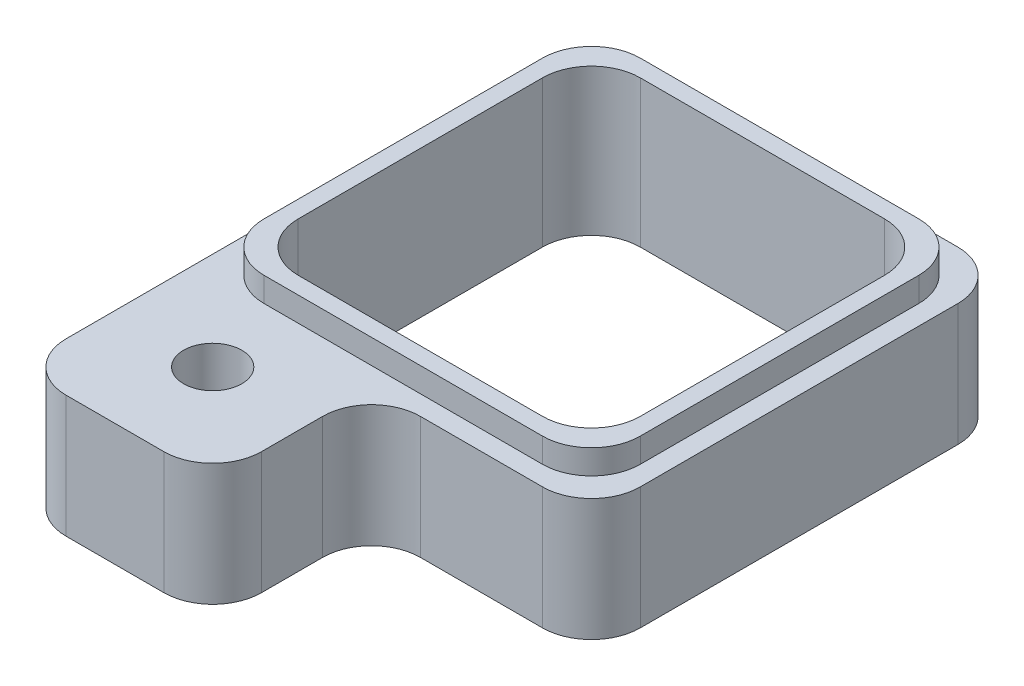
ISO-10303-21;
HEADER;
FILE_DESCRIPTION(('STEP AP214'),'2;1');
FILE_NAME('part.step','',(''),(''),'','','');
FILE_SCHEMA(('AUTOMOTIVE_DESIGN { 1 0 10303 214 1 1 1 1 }'));
ENDSEC;
DATA;
#1=APPLICATION_CONTEXT('core data for automotive mechanical design processes');
#2=APPLICATION_PROTOCOL_DEFINITION('international standard','automotive_design',2000,#1);
#3=PRODUCT_CONTEXT('',#1,'mechanical');
#4=PRODUCT('Part','Part','',(#3));
#5=PRODUCT_RELATED_PRODUCT_CATEGORY('part','',(#4));
#6=PRODUCT_DEFINITION_FORMATION('','',#4);
#7=PRODUCT_DEFINITION_CONTEXT('part definition',#1,'design');
#8=PRODUCT_DEFINITION('design','',#6,#7);
#9=PRODUCT_DEFINITION_SHAPE('','',#8);
#10=(LENGTH_UNIT() NAMED_UNIT(*) SI_UNIT(.MILLI.,.METRE.));
#11=(NAMED_UNIT(*) PLANE_ANGLE_UNIT() SI_UNIT($,.RADIAN.));
#12=(NAMED_UNIT(*) SI_UNIT($,.STERADIAN.) SOLID_ANGLE_UNIT());
#13=UNCERTAINTY_MEASURE_WITH_UNIT(LENGTH_MEASURE(1.E-05),#10,'distance_accuracy_value','');
#14=(GEOMETRIC_REPRESENTATION_CONTEXT(3) GLOBAL_UNCERTAINTY_ASSIGNED_CONTEXT((#13)) GLOBAL_UNIT_ASSIGNED_CONTEXT((#10,
#11,#12)) REPRESENTATION_CONTEXT('',''));
#15=CARTESIAN_POINT('',(0.,0.,0.));
#16=DIRECTION('',(0.,0.,1.));
#17=DIRECTION('',(1.,0.,0.));
#18=AXIS2_PLACEMENT_3D('',#15,#16,#17);
#19=CARTESIAN_POINT('',(-4.25,2.5,-4.25));
#20=DIRECTION('',(0.,0.,1.));
#21=DIRECTION('',(1.,0.,0.));
#22=AXIS2_PLACEMENT_3D('',#19,#20,#21);
#23=PLANE('',#22);
#24=DIRECTION('',(-1.,0.,0.));
#25=VECTOR('',#24,1.);
#26=CARTESIAN_POINT('',(-4.25,2.5,-4.25));
#27=LINE('',#26,#25);
#28=CARTESIAN_POINT('',(3.25,2.5,-4.25));
#29=VERTEX_POINT('',#28);
#30=CARTESIAN_POINT('',(-3.25,2.5,-4.25));
#31=VERTEX_POINT('',#30);
#32=EDGE_CURVE('E333',#29,#31,#27,.T.);
#33=ORIENTED_EDGE('',*,*,#32,.F.);
#34=DIRECTION('',(0.,-1.,0.));
#35=VECTOR('',#34,1.);
#36=CARTESIAN_POINT('',(3.25,2.5,-4.25));
#37=LINE('',#36,#35);
#38=CARTESIAN_POINT('',(3.25,0.,-4.25));
#39=VERTEX_POINT('',#38);
#40=EDGE_CURVE('E376',#29,#39,#37,.T.);
#41=ORIENTED_EDGE('',*,*,#40,.T.);
#42=DIRECTION('',(-1.,0.,0.));
#43=VECTOR('',#42,1.);
#44=CARTESIAN_POINT('',(-4.25,0.,-4.25));
#45=LINE('',#44,#43);
#46=CARTESIAN_POINT('',(1.42960296038314,0.,-4.25));
#47=VERTEX_POINT('',#46);
#48=EDGE_CURVE('E460',#39,#47,#45,.T.);
#49=ORIENTED_EDGE('',*,*,#48,.T.);
#50=DIRECTION('',(0.,-1.,0.));
#51=VECTOR('',#50,1.);
#52=CARTESIAN_POINT('',(1.42960296038314,1.,-4.25));
#53=LINE('',#52,#51);
#54=CARTESIAN_POINT('',(1.42960296038314,1.,-4.25));
#55=VERTEX_POINT('',#54);
#56=EDGE_CURVE('E260',#55,#47,#53,.T.);
#57=ORIENTED_EDGE('',*,*,#56,.F.);
#58=DIRECTION('',(1.,0.,0.));
#59=VECTOR('',#58,1.);
#60=CARTESIAN_POINT('',(1.42960296038314,1.,-4.25));
#61=LINE('',#60,#59);
#62=CARTESIAN_POINT('',(-0.570397039616865,1.,-4.25));
#63=VERTEX_POINT('',#62);
#64=EDGE_CURVE('E652',#63,#55,#61,.T.);
#65=ORIENTED_EDGE('',*,*,#64,.F.);
#66=DIRECTION('',(0.,1.,0.));
#67=VECTOR('',#66,1.);
#68=CARTESIAN_POINT('',(-0.570397039616865,1.,-4.25));
#69=LINE('',#68,#67);
#70=CARTESIAN_POINT('',(-0.570397039616865,0.,-4.25));
#71=VERTEX_POINT('',#70);
#72=EDGE_CURVE('E263',#71,#63,#69,.T.);
#73=ORIENTED_EDGE('',*,*,#72,.F.);
#74=CARTESIAN_POINT('',(-3.25,0.,-4.25));
#75=VERTEX_POINT('',#74);
#76=EDGE_CURVE('E457',#71,#75,#45,.T.);
#77=ORIENTED_EDGE('',*,*,#76,.T.);
#78=DIRECTION('',(0.,-1.,0.));
#79=VECTOR('',#78,1.);
#80=CARTESIAN_POINT('',(-3.25,2.5,-4.25));
#81=LINE('',#80,#79);
#82=EDGE_CURVE('E374',#75,#31,#81,.F.);
#83=ORIENTED_EDGE('',*,*,#82,.T.);
#84=EDGE_LOOP('',(#33,#41,#49,#57,#65,#73,#77,#83));
#85=FACE_BOUND('',#84,.T.);
#86=ADVANCED_FACE('F31',(#85),#23,.F.);
#87=CARTESIAN_POINT('',(-4.25,2.5,4.25));
#88=DIRECTION('',(0.,0.,-1.));
#89=DIRECTION('',(-1.,0.,0.));
#90=AXIS2_PLACEMENT_3D('',#87,#88,#89);
#91=PLANE('',#90);
#92=DIRECTION('',(1.,0.,0.));
#93=VECTOR('',#92,1.);
#94=CARTESIAN_POINT('',(-4.25,2.5,4.25));
#95=LINE('',#94,#93);
#96=CARTESIAN_POINT('',(0.749999999999997,2.5,4.25));
#97=VERTEX_POINT('',#96);
#98=CARTESIAN_POINT('',(3.25,2.5,4.25));
#99=VERTEX_POINT('',#98);
#100=EDGE_CURVE('E340',#97,#99,#95,.T.);
#101=ORIENTED_EDGE('',*,*,#100,.F.);
#102=DIRECTION('',(0.,1.,0.));
#103=VECTOR('',#102,1.);
#104=CARTESIAN_POINT('',(0.749999999999998,0.,4.25));
#105=LINE('',#104,#103);
#106=CARTESIAN_POINT('',(0.749999999999998,0.,4.25));
#107=VERTEX_POINT('',#106);
#108=EDGE_CURVE('E367',#97,#107,#105,.F.);
#109=ORIENTED_EDGE('',*,*,#108,.T.);
#110=DIRECTION('',(1.,0.,0.));
#111=VECTOR('',#110,1.);
#112=CARTESIAN_POINT('',(-4.25,0.,4.25));
#113=LINE('',#112,#111);
#114=CARTESIAN_POINT('',(3.25,0.,4.25));
#115=VERTEX_POINT('',#114);
#116=EDGE_CURVE('E334',#107,#115,#113,.T.);
#117=ORIENTED_EDGE('',*,*,#116,.T.);
#118=DIRECTION('',(0.,-1.,0.));
#119=VECTOR('',#118,1.);
#120=CARTESIAN_POINT('',(3.25,2.5,4.25));
#121=LINE('',#120,#119);
#122=EDGE_CURVE('E46',#115,#99,#121,.F.);
#123=ORIENTED_EDGE('',*,*,#122,.T.);
#124=EDGE_LOOP('',(#101,#109,#117,#123));
#125=FACE_BOUND('',#124,.T.);
#126=ADVANCED_FACE('F510',(#125),#91,.F.);
#127=CARTESIAN_POINT('',(4.25,2.5,-4.25));
#128=DIRECTION('',(0.,-1.,0.));
#129=DIRECTION('',(0.,0.,-1.));
#130=AXIS2_PLACEMENT_3D('',#127,#128,#129);
#131=PLANE('',#130);
#132=CARTESIAN_POINT('',(-2.25,2.5,5.5));
#133=DIRECTION('',(0.,1.,0.));
#134=DIRECTION('',(0.,0.,1.));
#135=AXIS2_PLACEMENT_3D('',#132,#133,#134);
#136=CIRCLE('',#135,0.595629999999988);
#137=CARTESIAN_POINT('',(-2.25,2.5,6.09562999999999));
#138=VERTEX_POINT('',#137);
#139=EDGE_CURVE('E264',#138,#138,#136,.T.);
#140=ORIENTED_EDGE('',*,*,#139,.F.);
#141=EDGE_LOOP('',(#140));
#142=FACE_BOUND('',#141,.T.);
#143=DIRECTION('',(0.,0.,1.));
#144=VECTOR('',#143,1.);
#145=CARTESIAN_POINT('',(-4.25,2.5,4.25));
#146=LINE('',#145,#144);
#147=CARTESIAN_POINT('',(-4.25,2.5,-3.25));
#148=VERTEX_POINT('',#147);
#149=CARTESIAN_POINT('',(-4.25,2.5,6.5));
#150=VERTEX_POINT('',#149);
#151=EDGE_CURVE('E337',#148,#150,#146,.T.);
#152=ORIENTED_EDGE('',*,*,#151,.T.);
#153=CARTESIAN_POINT('',(-3.25,2.5,6.5));
#154=DIRECTION('',(0.,-1.,0.));
#155=DIRECTION('',(0.,0.,-1.));
#156=AXIS2_PLACEMENT_3D('',#153,#154,#155);
#157=CIRCLE('',#156,1.);
#158=CARTESIAN_POINT('',(-3.25,2.5,7.5));
#159=VERTEX_POINT('',#158);
#160=EDGE_CURVE('E359',#150,#159,#157,.F.);
#161=ORIENTED_EDGE('',*,*,#160,.T.);
#162=DIRECTION('',(-1.,0.,0.));
#163=VECTOR('',#162,1.);
#164=CARTESIAN_POINT('',(-4.25,2.5,7.5));
#165=LINE('',#164,#163);
#166=CARTESIAN_POINT('',(-1.25,2.5,7.5));
#167=VERTEX_POINT('',#166);
#168=EDGE_CURVE('E300',#167,#159,#165,.T.);
#169=ORIENTED_EDGE('',*,*,#168,.F.);
#170=CARTESIAN_POINT('',(-1.25,2.5,6.5));
#171=DIRECTION('',(0.,-1.,0.));
#172=DIRECTION('',(0.,0.,-1.));
#173=AXIS2_PLACEMENT_3D('',#170,#171,#172);
#174=CIRCLE('',#173,1.);
#175=CARTESIAN_POINT('',(-0.250000000000002,2.5,6.5));
#176=VERTEX_POINT('',#175);
#177=EDGE_CURVE('E357',#167,#176,#174,.F.);
#178=ORIENTED_EDGE('',*,*,#177,.T.);
#179=DIRECTION('',(0.,0.,-1.));
#180=VECTOR('',#179,1.);
#181=CARTESIAN_POINT('',(-0.250000000000002,2.5,7.5));
#182=LINE('',#181,#180);
#183=CARTESIAN_POINT('',(-0.250000000000002,2.5,5.25));
#184=VERTEX_POINT('',#183);
#185=EDGE_CURVE('E303',#176,#184,#182,.T.);
#186=ORIENTED_EDGE('',*,*,#185,.T.);
#187=CARTESIAN_POINT('',(0.749999999999998,2.5,5.25));
#188=DIRECTION('',(0.,-1.,0.));
#189=DIRECTION('',(0.,0.,-1.));
#190=AXIS2_PLACEMENT_3D('',#187,#188,#189);
#191=CIRCLE('',#190,1.);
#192=EDGE_CURVE('E39',#184,#97,#191,.T.);
#193=ORIENTED_EDGE('',*,*,#192,.T.);
#194=ORIENTED_EDGE('',*,*,#100,.T.);
#195=CARTESIAN_POINT('',(3.25,2.5,3.25));
#196=DIRECTION('',(0.,-1.,0.));
#197=DIRECTION('',(0.,0.,-1.));
#198=AXIS2_PLACEMENT_3D('',#195,#196,#197);
#199=CIRCLE('',#198,1.);
#200=CARTESIAN_POINT('',(4.25,2.5,3.25));
#201=VERTEX_POINT('',#200);
#202=EDGE_CURVE('E355',#99,#201,#199,.F.);
#203=ORIENTED_EDGE('',*,*,#202,.T.);
#204=DIRECTION('',(0.,0.,-1.));
#205=VECTOR('',#204,1.);
#206=CARTESIAN_POINT('',(4.25,2.5,4.25));
#207=LINE('',#206,#205);
#208=CARTESIAN_POINT('',(4.25,2.5,-3.25));
#209=VERTEX_POINT('',#208);
#210=EDGE_CURVE('E330',#201,#209,#207,.T.);
#211=ORIENTED_EDGE('',*,*,#210,.T.);
#212=CARTESIAN_POINT('',(3.25,2.5,-3.25));
#213=DIRECTION('',(0.,-1.,0.));
#214=DIRECTION('',(0.,0.,-1.));
#215=AXIS2_PLACEMENT_3D('',#212,#213,#214);
#216=CIRCLE('',#215,1.);
#217=EDGE_CURVE('E352',#209,#29,#216,.F.);
#218=ORIENTED_EDGE('',*,*,#217,.T.);
#219=ORIENTED_EDGE('',*,*,#32,.T.);
#220=CARTESIAN_POINT('',(-3.25,2.5,-3.25));
#221=DIRECTION('',(0.,-1.,0.));
#222=DIRECTION('',(0.,0.,-1.));
#223=AXIS2_PLACEMENT_3D('',#220,#221,#222);
#224=CIRCLE('',#223,1.);
#225=EDGE_CURVE('E350',#31,#148,#224,.F.);
#226=ORIENTED_EDGE('',*,*,#225,.T.);
#227=EDGE_LOOP('',(#152,#161,#169,#178,#186,#193,#194,#203,#211,#218,#219,#226));
#228=FACE_BOUND('',#227,.T.);
#229=DIRECTION('',(0.,0.,1.));
#230=VECTOR('',#229,1.);
#231=CARTESIAN_POINT('',(-3.85,2.5,-3.85));
#232=LINE('',#231,#230);
#233=CARTESIAN_POINT('',(-3.85,2.5,-2.85));
#234=VERTEX_POINT('',#233);
#235=CARTESIAN_POINT('',(-3.85,2.5,2.85));
#236=VERTEX_POINT('',#235);
#237=EDGE_CURVE('E318',#234,#236,#232,.T.);
#238=ORIENTED_EDGE('',*,*,#237,.F.);
#239=CARTESIAN_POINT('',(-2.85,2.5,-2.85));
#240=DIRECTION('',(0.,-1.,0.));
#241=DIRECTION('',(0.,0.,-1.));
#242=AXIS2_PLACEMENT_3D('',#239,#240,#241);
#243=CIRCLE('',#242,1.);
#244=CARTESIAN_POINT('',(-2.85,2.5,-3.85));
#245=VERTEX_POINT('',#244);
#246=EDGE_CURVE('E381',#234,#245,#243,.T.);
#247=ORIENTED_EDGE('',*,*,#246,.T.);
#248=DIRECTION('',(-1.,0.,0.));
#249=VECTOR('',#248,1.);
#250=CARTESIAN_POINT('',(3.85,2.5,-3.85));
#251=LINE('',#250,#249);
#252=CARTESIAN_POINT('',(2.85,2.5,-3.85));
#253=VERTEX_POINT('',#252);
#254=EDGE_CURVE('E308',#253,#245,#251,.T.);
#255=ORIENTED_EDGE('',*,*,#254,.F.);
#256=CARTESIAN_POINT('',(2.85,2.5,-2.85));
#257=DIRECTION('',(0.,-1.,0.));
#258=DIRECTION('',(0.,0.,-1.));
#259=AXIS2_PLACEMENT_3D('',#256,#257,#258);
#260=CIRCLE('',#259,1.);
#261=CARTESIAN_POINT('',(3.85,2.5,-2.85));
#262=VERTEX_POINT('',#261);
#263=EDGE_CURVE('E383',#253,#262,#260,.T.);
#264=ORIENTED_EDGE('',*,*,#263,.T.);
#265=DIRECTION('',(0.,0.,-1.));
#266=VECTOR('',#265,1.);
#267=CARTESIAN_POINT('',(3.85,2.5,3.85));
#268=LINE('',#267,#266);
#269=CARTESIAN_POINT('',(3.85,2.5,2.85));
#270=VERTEX_POINT('',#269);
#271=EDGE_CURVE('E325',#270,#262,#268,.T.);
#272=ORIENTED_EDGE('',*,*,#271,.F.);
#273=CARTESIAN_POINT('',(2.85,2.5,2.85));
#274=DIRECTION('',(0.,-1.,0.));
#275=DIRECTION('',(0.,0.,-1.));
#276=AXIS2_PLACEMENT_3D('',#273,#274,#275);
#277=CIRCLE('',#276,1.);
#278=CARTESIAN_POINT('',(2.85,2.5,3.85));
#279=VERTEX_POINT('',#278);
#280=EDGE_CURVE('E385',#270,#279,#277,.T.);
#281=ORIENTED_EDGE('',*,*,#280,.T.);
#282=DIRECTION('',(1.,0.,0.));
#283=VECTOR('',#282,1.);
#284=CARTESIAN_POINT('',(-3.85,2.5,3.85));
#285=LINE('',#284,#283);
#286=CARTESIAN_POINT('',(-2.85,2.5,3.85));
#287=VERTEX_POINT('',#286);
#288=EDGE_CURVE('E321',#287,#279,#285,.T.);
#289=ORIENTED_EDGE('',*,*,#288,.F.);
#290=CARTESIAN_POINT('',(-2.85,2.5,2.85));
#291=DIRECTION('',(0.,-1.,0.));
#292=DIRECTION('',(0.,0.,-1.));
#293=AXIS2_PLACEMENT_3D('',#290,#291,#292);
#294=CIRCLE('',#293,1.);
#295=EDGE_CURVE('E379',#287,#236,#294,.T.);
#296=ORIENTED_EDGE('',*,*,#295,.T.);
#297=EDGE_LOOP('',(#238,#247,#255,#264,#272,#281,#289,#296));
#298=FACE_BOUND('',#297,.T.);
#299=ADVANCED_FACE('F485',(#142,#228,#298),#131,.F.);
#300=CARTESIAN_POINT('',(4.25,2.5,4.25));
#301=DIRECTION('',(-1.,0.,0.));
#302=DIRECTION('',(0.,0.,1.));
#303=AXIS2_PLACEMENT_3D('',#300,#301,#302);
#304=PLANE('',#303);
#305=ORIENTED_EDGE('',*,*,#210,.F.);
#306=DIRECTION('',(0.,-1.,0.));
#307=VECTOR('',#306,1.);
#308=CARTESIAN_POINT('',(4.25,2.5,3.25));
#309=LINE('',#308,#307);
#310=CARTESIAN_POINT('',(4.25,0.,3.25));
#311=VERTEX_POINT('',#310);
#312=EDGE_CURVE('E371',#201,#311,#309,.T.);
#313=ORIENTED_EDGE('',*,*,#312,.T.);
#314=DIRECTION('',(0.,0.,-1.));
#315=VECTOR('',#314,1.);
#316=CARTESIAN_POINT('',(4.25,0.,4.25));
#317=LINE('',#316,#315);
#318=CARTESIAN_POINT('',(4.25,0.,-3.25));
#319=VERTEX_POINT('',#318);
#320=EDGE_CURVE('E317',#311,#319,#317,.T.);
#321=ORIENTED_EDGE('',*,*,#320,.T.);
#322=DIRECTION('',(0.,-1.,0.));
#323=VECTOR('',#322,1.);
#324=CARTESIAN_POINT('',(4.25,2.5,-3.25));
#325=LINE('',#324,#323);
#326=EDGE_CURVE('E369',#319,#209,#325,.F.);
#327=ORIENTED_EDGE('',*,*,#326,.T.);
#328=EDGE_LOOP('',(#305,#313,#321,#327));
#329=FACE_BOUND('',#328,.T.);
#330=ADVANCED_FACE('F519',(#329),#304,.F.);
#331=CARTESIAN_POINT('',(-4.25,2.5,4.25));
#332=DIRECTION('',(1.,0.,0.));
#333=DIRECTION('',(0.,0.,-1.));
#334=AXIS2_PLACEMENT_3D('',#331,#332,#333);
#335=PLANE('',#334);
#336=DIRECTION('',(0.,0.,1.));
#337=VECTOR('',#336,1.);
#338=CARTESIAN_POINT('',(-4.25,0.,4.25));
#339=LINE('',#338,#337);
#340=CARTESIAN_POINT('',(-4.25,0.,-3.25));
#341=VERTEX_POINT('',#340);
#342=CARTESIAN_POINT('',(-4.25,0.,6.5));
#343=VERTEX_POINT('',#342);
#344=EDGE_CURVE('E447',#341,#343,#339,.T.);
#345=ORIENTED_EDGE('',*,*,#344,.T.);
#346=DIRECTION('',(0.,-1.,0.));
#347=VECTOR('',#346,1.);
#348=CARTESIAN_POINT('',(-4.25,2.5,6.5));
#349=LINE('',#348,#347);
#350=EDGE_CURVE('E353',#343,#150,#349,.F.);
#351=ORIENTED_EDGE('',*,*,#350,.T.);
#352=ORIENTED_EDGE('',*,*,#151,.F.);
#353=DIRECTION('',(0.,-1.,0.));
#354=VECTOR('',#353,1.);
#355=CARTESIAN_POINT('',(-4.25,2.5,-3.25));
#356=LINE('',#355,#354);
#357=EDGE_CURVE('E474',#148,#341,#356,.T.);
#358=ORIENTED_EDGE('',*,*,#357,.T.);
#359=EDGE_LOOP('',(#345,#351,#352,#358));
#360=FACE_BOUND('',#359,.T.);
#361=ADVANCED_FACE('F480',(#360),#335,.F.);
#362=CARTESIAN_POINT('',(4.25,0.,-4.25));
#363=DIRECTION('',(0.,-1.,0.));
#364=DIRECTION('',(0.,0.,-1.));
#365=AXIS2_PLACEMENT_3D('',#362,#363,#364);
#366=PLANE('',#365);
#367=CARTESIAN_POINT('',(-2.25,0.,5.5));
#368=DIRECTION('',(0.,-1.,0.));
#369=DIRECTION('',(0.,0.,-1.));
#370=AXIS2_PLACEMENT_3D('',#367,#368,#369);
#371=CIRCLE('',#370,0.595629999999993);
#372=CARTESIAN_POINT('',(-2.25,0.,4.90437000000001));
#373=VERTEX_POINT('',#372);
#374=EDGE_CURVE('E267',#373,#373,#371,.T.);
#375=ORIENTED_EDGE('',*,*,#374,.F.);
#376=EDGE_LOOP('',(#375));
#377=FACE_BOUND('',#376,.T.);
#378=DIRECTION('',(0.,0.,1.));
#379=VECTOR('',#378,1.);
#380=CARTESIAN_POINT('',(3.5,0.,-4.25));
#381=LINE('',#380,#379);
#382=CARTESIAN_POINT('',(3.5,0.,-2.5));
#383=VERTEX_POINT('',#382);
#384=CARTESIAN_POINT('',(3.5,0.,2.5));
#385=VERTEX_POINT('',#384);
#386=EDGE_CURVE('E294',#383,#385,#381,.T.);
#387=ORIENTED_EDGE('',*,*,#386,.F.);
#388=CARTESIAN_POINT('',(2.5,0.,-2.5));
#389=DIRECTION('',(0.,-1.,0.));
#390=DIRECTION('',(0.,0.,-1.));
#391=AXIS2_PLACEMENT_3D('',#388,#389,#390);
#392=CIRCLE('',#391,1.);
#393=CARTESIAN_POINT('',(2.5,0.,-3.5));
#394=VERTEX_POINT('',#393);
#395=EDGE_CURVE('E389',#383,#394,#392,.F.);
#396=ORIENTED_EDGE('',*,*,#395,.T.);
#397=DIRECTION('',(1.,0.,0.));
#398=VECTOR('',#397,1.);
#399=CARTESIAN_POINT('',(4.25,0.,-3.5));
#400=LINE('',#399,#398);
#401=CARTESIAN_POINT('',(-2.5,0.,-3.5));
#402=VERTEX_POINT('',#401);
#403=EDGE_CURVE('E285',#402,#394,#400,.T.);
#404=ORIENTED_EDGE('',*,*,#403,.F.);
#405=CARTESIAN_POINT('',(-2.5,0.,-2.5));
#406=DIRECTION('',(0.,-1.,0.));
#407=DIRECTION('',(0.,0.,-1.));
#408=AXIS2_PLACEMENT_3D('',#405,#406,#407);
#409=CIRCLE('',#408,1.);
#410=CARTESIAN_POINT('',(-3.5,0.,-2.5));
#411=VERTEX_POINT('',#410);
#412=EDGE_CURVE('E393',#402,#411,#409,.F.);
#413=ORIENTED_EDGE('',*,*,#412,.T.);
#414=DIRECTION('',(0.,0.,-1.));
#415=VECTOR('',#414,1.);
#416=CARTESIAN_POINT('',(-3.5,0.,-4.25));
#417=LINE('',#416,#415);
#418=CARTESIAN_POINT('',(-3.5,0.,2.5));
#419=VERTEX_POINT('',#418);
#420=EDGE_CURVE('E288',#419,#411,#417,.T.);
#421=ORIENTED_EDGE('',*,*,#420,.F.);
#422=CARTESIAN_POINT('',(-2.5,0.,2.5));
#423=DIRECTION('',(0.,-1.,0.));
#424=DIRECTION('',(0.,0.,-1.));
#425=AXIS2_PLACEMENT_3D('',#422,#423,#424);
#426=CIRCLE('',#425,1.);
#427=CARTESIAN_POINT('',(-2.5,0.,3.5));
#428=VERTEX_POINT('',#427);
#429=EDGE_CURVE('E397',#419,#428,#426,.F.);
#430=ORIENTED_EDGE('',*,*,#429,.T.);
#431=DIRECTION('',(-1.,0.,0.));
#432=VECTOR('',#431,1.);
#433=CARTESIAN_POINT('',(4.25,0.,3.5));
#434=LINE('',#433,#432);
#435=CARTESIAN_POINT('',(2.5,0.,3.5));
#436=VERTEX_POINT('',#435);
#437=EDGE_CURVE('E291',#436,#428,#434,.T.);
#438=ORIENTED_EDGE('',*,*,#437,.F.);
#439=CARTESIAN_POINT('',(2.5,0.,2.5));
#440=DIRECTION('',(0.,-1.,0.));
#441=DIRECTION('',(0.,0.,-1.));
#442=AXIS2_PLACEMENT_3D('',#439,#440,#441);
#443=CIRCLE('',#442,1.);
#444=EDGE_CURVE('E401',#436,#385,#443,.F.);
#445=ORIENTED_EDGE('',*,*,#444,.T.);
#446=EDGE_LOOP('',(#387,#396,#404,#413,#421,#430,#438,#445));
#447=FACE_BOUND('',#446,.T.);
#448=DIRECTION('',(1.,0.,0.));
#449=VECTOR('',#448,1.);
#450=CARTESIAN_POINT('',(-4.25,0.,7.5));
#451=LINE('',#450,#449);
#452=CARTESIAN_POINT('',(-3.25,0.,7.5));
#453=VERTEX_POINT('',#452);
#454=CARTESIAN_POINT('',(-1.25,0.,7.5));
#455=VERTEX_POINT('',#454);
#456=EDGE_CURVE('E297',#453,#455,#451,.T.);
#457=ORIENTED_EDGE('',*,*,#456,.F.);
#458=CARTESIAN_POINT('',(-3.25,0.,6.5));
#459=DIRECTION('',(0.,-1.,0.));
#460=DIRECTION('',(0.,0.,-1.));
#461=AXIS2_PLACEMENT_3D('',#458,#459,#460);
#462=CIRCLE('',#461,1.);
#463=EDGE_CURVE('E472',#453,#343,#462,.T.);
#464=ORIENTED_EDGE('',*,*,#463,.T.);
#465=ORIENTED_EDGE('',*,*,#344,.F.);
#466=CARTESIAN_POINT('',(-3.25,0.,-3.25));
#467=DIRECTION('',(0.,-1.,0.));
#468=DIRECTION('',(0.,0.,-1.));
#469=AXIS2_PLACEMENT_3D('',#466,#467,#468);
#470=CIRCLE('',#469,1.);
#471=EDGE_CURVE('E444',#341,#75,#470,.T.);
#472=ORIENTED_EDGE('',*,*,#471,.T.);
#473=ORIENTED_EDGE('',*,*,#76,.F.);
#474=DIRECTION('',(0.,0.,1.));
#475=VECTOR('',#474,1.);
#476=CARTESIAN_POINT('',(-0.570397039616865,0.,-5.75));
#477=LINE('',#476,#475);
#478=CARTESIAN_POINT('',(-0.570397039616865,0.,-5.75));
#479=VERTEX_POINT('',#478);
#480=EDGE_CURVE('E532',#479,#71,#477,.T.);
#481=ORIENTED_EDGE('',*,*,#480,.F.);
#482=DIRECTION('',(-1.,0.,0.));
#483=VECTOR('',#482,1.);
#484=CARTESIAN_POINT('',(1.42960296038314,0.,-5.75));
#485=LINE('',#484,#483);
#486=CARTESIAN_POINT('',(1.42960296038314,0.,-5.75));
#487=VERTEX_POINT('',#486);
#488=EDGE_CURVE('E256',#487,#479,#485,.T.);
#489=ORIENTED_EDGE('',*,*,#488,.F.);
#490=DIRECTION('',(0.,0.,1.));
#491=VECTOR('',#490,1.);
#492=CARTESIAN_POINT('',(1.42960296038314,0.,-5.75));
#493=LINE('',#492,#491);
#494=EDGE_CURVE('E269',#487,#47,#493,.T.);
#495=ORIENTED_EDGE('',*,*,#494,.T.);
#496=ORIENTED_EDGE('',*,*,#48,.F.);
#497=CARTESIAN_POINT('',(3.25,0.,-3.25));
#498=DIRECTION('',(0.,-1.,0.));
#499=DIRECTION('',(0.,0.,-1.));
#500=AXIS2_PLACEMENT_3D('',#497,#498,#499);
#501=CIRCLE('',#500,1.);
#502=EDGE_CURVE('E466',#39,#319,#501,.T.);
#503=ORIENTED_EDGE('',*,*,#502,.T.);
#504=ORIENTED_EDGE('',*,*,#320,.F.);
#505=CARTESIAN_POINT('',(3.25,0.,3.25));
#506=DIRECTION('',(0.,-1.,0.));
#507=DIRECTION('',(0.,0.,-1.));
#508=AXIS2_PLACEMENT_3D('',#505,#506,#507);
#509=CIRCLE('',#508,1.);
#510=EDGE_CURVE('E468',#311,#115,#509,.T.);
#511=ORIENTED_EDGE('',*,*,#510,.T.);
#512=ORIENTED_EDGE('',*,*,#116,.F.);
#513=CARTESIAN_POINT('',(0.749999999999998,0.,5.25));
#514=DIRECTION('',(0.,-1.,0.));
#515=DIRECTION('',(0.,0.,-1.));
#516=AXIS2_PLACEMENT_3D('',#513,#514,#515);
#517=CIRCLE('',#516,1.);
#518=CARTESIAN_POINT('',(-0.250000000000002,0.,5.25));
#519=VERTEX_POINT('',#518);
#520=EDGE_CURVE('E11',#107,#519,#517,.F.);
#521=ORIENTED_EDGE('',*,*,#520,.T.);
#522=DIRECTION('',(0.,0.,-1.));
#523=VECTOR('',#522,1.);
#524=CARTESIAN_POINT('',(-0.250000000000002,0.,7.5));
#525=LINE('',#524,#523);
#526=CARTESIAN_POINT('',(-0.250000000000002,0.,6.5));
#527=VERTEX_POINT('',#526);
#528=EDGE_CURVE('E322',#527,#519,#525,.T.);
#529=ORIENTED_EDGE('',*,*,#528,.F.);
#530=CARTESIAN_POINT('',(-1.25,0.,6.5));
#531=DIRECTION('',(0.,-1.,0.));
#532=DIRECTION('',(0.,0.,-1.));
#533=AXIS2_PLACEMENT_3D('',#530,#531,#532);
#534=CIRCLE('',#533,1.);
#535=EDGE_CURVE('E470',#527,#455,#534,.T.);
#536=ORIENTED_EDGE('',*,*,#535,.T.);
#537=EDGE_LOOP('',(#457,#464,#465,#472,#473,#481,#489,#495,#496,#503,#504,#511,#512,#521,#529,#536));
#538=FACE_BOUND('',#537,.T.);
#539=ADVANCED_FACE('F406',(#377,#447,#538),#366,.T.);
#540=CARTESIAN_POINT('',(-3.85,3.,-3.85));
#541=DIRECTION('',(1.,0.,0.));
#542=DIRECTION('',(0.,0.,-1.));
#543=AXIS2_PLACEMENT_3D('',#540,#541,#542);
#544=PLANE('',#543);
#545=ORIENTED_EDGE('',*,*,#237,.T.);
#546=DIRECTION('',(0.,-1.,0.));
#547=VECTOR('',#546,1.);
#548=CARTESIAN_POINT('',(-3.85,3.,2.85));
#549=LINE('',#548,#547);
#550=CARTESIAN_POINT('',(-3.85,3.,2.85));
#551=VERTEX_POINT('',#550);
#552=EDGE_CURVE('E547',#236,#551,#549,.F.);
#553=ORIENTED_EDGE('',*,*,#552,.T.);
#554=DIRECTION('',(0.,0.,1.));
#555=VECTOR('',#554,1.);
#556=CARTESIAN_POINT('',(-3.85,3.,-3.85));
#557=LINE('',#556,#555);
#558=CARTESIAN_POINT('',(-3.85,3.,-2.85));
#559=VERTEX_POINT('',#558);
#560=EDGE_CURVE('E304',#559,#551,#557,.T.);
#561=ORIENTED_EDGE('',*,*,#560,.F.);
#562=DIRECTION('',(0.,-1.,0.));
#563=VECTOR('',#562,1.);
#564=CARTESIAN_POINT('',(-3.85,3.,-2.85));
#565=LINE('',#564,#563);
#566=EDGE_CURVE('E544',#559,#234,#565,.T.);
#567=ORIENTED_EDGE('',*,*,#566,.T.);
#568=EDGE_LOOP('',(#545,#553,#561,#567));
#569=FACE_BOUND('',#568,.T.);
#570=ADVANCED_FACE('F685',(#569),#544,.F.);
#571=CARTESIAN_POINT('',(-3.85,3.,3.85));
#572=DIRECTION('',(0.,0.,-1.));
#573=DIRECTION('',(-1.,0.,0.));
#574=AXIS2_PLACEMENT_3D('',#571,#572,#573);
#575=PLANE('',#574);
#576=DIRECTION('',(1.,0.,0.));
#577=VECTOR('',#576,1.);
#578=CARTESIAN_POINT('',(-3.85,3.,3.85));
#579=LINE('',#578,#577);
#580=CARTESIAN_POINT('',(-2.85,3.,3.85));
#581=VERTEX_POINT('',#580);
#582=CARTESIAN_POINT('',(2.85,3.,3.85));
#583=VERTEX_POINT('',#582);
#584=EDGE_CURVE('E307',#581,#583,#579,.T.);
#585=ORIENTED_EDGE('',*,*,#584,.F.);
#586=DIRECTION('',(0.,-1.,0.));
#587=VECTOR('',#586,1.);
#588=CARTESIAN_POINT('',(-2.85,3.,3.85));
#589=LINE('',#588,#587);
#590=EDGE_CURVE('E541',#581,#287,#589,.T.);
#591=ORIENTED_EDGE('',*,*,#590,.T.);
#592=ORIENTED_EDGE('',*,*,#288,.T.);
#593=DIRECTION('',(0.,-1.,0.));
#594=VECTOR('',#593,1.);
#595=CARTESIAN_POINT('',(2.85,3.,3.85));
#596=LINE('',#595,#594);
#597=EDGE_CURVE('E347',#279,#583,#596,.F.);
#598=ORIENTED_EDGE('',*,*,#597,.T.);
#599=EDGE_LOOP('',(#585,#591,#592,#598));
#600=FACE_BOUND('',#599,.T.);
#601=ADVANCED_FACE('F693',(#600),#575,.F.);
#602=CARTESIAN_POINT('',(3.85,3.,3.85));
#603=DIRECTION('',(-1.,0.,0.));
#604=DIRECTION('',(0.,0.,1.));
#605=AXIS2_PLACEMENT_3D('',#602,#603,#604);
#606=PLANE('',#605);
#607=ORIENTED_EDGE('',*,*,#271,.T.);
#608=DIRECTION('',(0.,-1.,0.));
#609=VECTOR('',#608,1.);
#610=CARTESIAN_POINT('',(3.85,3.,-2.85));
#611=LINE('',#610,#609);
#612=CARTESIAN_POINT('',(3.85,3.,-2.85));
#613=VERTEX_POINT('',#612);
#614=EDGE_CURVE('E565',#262,#613,#611,.F.);
#615=ORIENTED_EDGE('',*,*,#614,.T.);
#616=DIRECTION('',(0.,0.,-1.));
#617=VECTOR('',#616,1.);
#618=CARTESIAN_POINT('',(3.85,3.,3.85));
#619=LINE('',#618,#617);
#620=CARTESIAN_POINT('',(3.85,3.,2.85));
#621=VERTEX_POINT('',#620);
#622=EDGE_CURVE('E311',#621,#613,#619,.T.);
#623=ORIENTED_EDGE('',*,*,#622,.F.);
#624=DIRECTION('',(0.,-1.,0.));
#625=VECTOR('',#624,1.);
#626=CARTESIAN_POINT('',(3.85,3.,2.85));
#627=LINE('',#626,#625);
#628=EDGE_CURVE('E562',#621,#270,#627,.T.);
#629=ORIENTED_EDGE('',*,*,#628,.T.);
#630=EDGE_LOOP('',(#607,#615,#623,#629));
#631=FACE_BOUND('',#630,.T.);
#632=ADVANCED_FACE('F809',(#631),#606,.F.);
#633=CARTESIAN_POINT('',(3.85,3.,-3.85));
#634=DIRECTION('',(0.,0.,1.));
#635=DIRECTION('',(1.,0.,0.));
#636=AXIS2_PLACEMENT_3D('',#633,#634,#635);
#637=PLANE('',#636);
#638=ORIENTED_EDGE('',*,*,#254,.T.);
#639=DIRECTION('',(0.,-1.,0.));
#640=VECTOR('',#639,1.);
#641=CARTESIAN_POINT('',(-2.85,3.,-3.85));
#642=LINE('',#641,#640);
#643=CARTESIAN_POINT('',(-2.85,3.,-3.85));
#644=VERTEX_POINT('',#643);
#645=EDGE_CURVE('E560',#245,#644,#642,.F.);
#646=ORIENTED_EDGE('',*,*,#645,.T.);
#647=DIRECTION('',(-1.,0.,0.));
#648=VECTOR('',#647,1.);
#649=CARTESIAN_POINT('',(3.85,3.,-3.85));
#650=LINE('',#649,#648);
#651=CARTESIAN_POINT('',(2.85,3.,-3.85));
#652=VERTEX_POINT('',#651);
#653=EDGE_CURVE('E314',#652,#644,#650,.T.);
#654=ORIENTED_EDGE('',*,*,#653,.F.);
#655=DIRECTION('',(0.,-1.,0.));
#656=VECTOR('',#655,1.);
#657=CARTESIAN_POINT('',(2.85,3.,-3.85));
#658=LINE('',#657,#656);
#659=EDGE_CURVE('E557',#652,#253,#658,.T.);
#660=ORIENTED_EDGE('',*,*,#659,.T.);
#661=EDGE_LOOP('',(#638,#646,#654,#660));
#662=FACE_BOUND('',#661,.T.);
#663=ADVANCED_FACE('F818',(#662),#637,.F.);
#664=CARTESIAN_POINT('',(-3.85,3.,3.85));
#665=DIRECTION('',(0.,1.,0.));
#666=DIRECTION('',(0.,0.,1.));
#667=AXIS2_PLACEMENT_3D('',#664,#665,#666);
#668=PLANE('',#667);
#669=DIRECTION('',(0.,0.,-1.));
#670=VECTOR('',#669,1.);
#671=CARTESIAN_POINT('',(3.5,3.,3.5));
#672=LINE('',#671,#670);
#673=CARTESIAN_POINT('',(3.5,3.,2.5));
#674=VERTEX_POINT('',#673);
#675=CARTESIAN_POINT('',(3.5,3.,-2.5));
#676=VERTEX_POINT('',#675);
#677=EDGE_CURVE('E273',#674,#676,#672,.T.);
#678=ORIENTED_EDGE('',*,*,#677,.F.);
#679=CARTESIAN_POINT('',(2.5,3.,2.5));
#680=DIRECTION('',(0.,1.,0.));
#681=DIRECTION('',(0.,0.,1.));
#682=AXIS2_PLACEMENT_3D('',#679,#680,#681);
#683=CIRCLE('',#682,1.);
#684=CARTESIAN_POINT('',(2.5,3.,3.5));
#685=VERTEX_POINT('',#684);
#686=EDGE_CURVE('E399',#674,#685,#683,.F.);
#687=ORIENTED_EDGE('',*,*,#686,.T.);
#688=DIRECTION('',(1.,0.,0.));
#689=VECTOR('',#688,1.);
#690=CARTESIAN_POINT('',(-3.5,3.,3.5));
#691=LINE('',#690,#689);
#692=CARTESIAN_POINT('',(-2.5,3.,3.5));
#693=VERTEX_POINT('',#692);
#694=EDGE_CURVE('E282',#693,#685,#691,.T.);
#695=ORIENTED_EDGE('',*,*,#694,.F.);
#696=CARTESIAN_POINT('',(-2.5,3.,2.5));
#697=DIRECTION('',(0.,1.,0.));
#698=DIRECTION('',(0.,0.,1.));
#699=AXIS2_PLACEMENT_3D('',#696,#697,#698);
#700=CIRCLE('',#699,1.);
#701=CARTESIAN_POINT('',(-3.5,3.,2.5));
#702=VERTEX_POINT('',#701);
#703=EDGE_CURVE('E395',#693,#702,#700,.F.);
#704=ORIENTED_EDGE('',*,*,#703,.T.);
#705=DIRECTION('',(0.,0.,1.));
#706=VECTOR('',#705,1.);
#707=CARTESIAN_POINT('',(-3.5,3.,3.5));
#708=LINE('',#707,#706);
#709=CARTESIAN_POINT('',(-3.5,3.,-2.5));
#710=VERTEX_POINT('',#709);
#711=EDGE_CURVE('E279',#710,#702,#708,.T.);
#712=ORIENTED_EDGE('',*,*,#711,.F.);
#713=CARTESIAN_POINT('',(-2.5,3.,-2.5));
#714=DIRECTION('',(0.,1.,0.));
#715=DIRECTION('',(0.,0.,1.));
#716=AXIS2_PLACEMENT_3D('',#713,#714,#715);
#717=CIRCLE('',#716,1.);
#718=CARTESIAN_POINT('',(-2.5,3.,-3.5));
#719=VERTEX_POINT('',#718);
#720=EDGE_CURVE('E391',#710,#719,#717,.F.);
#721=ORIENTED_EDGE('',*,*,#720,.T.);
#722=DIRECTION('',(-1.,0.,0.));
#723=VECTOR('',#722,1.);
#724=CARTESIAN_POINT('',(-3.5,3.,-3.5));
#725=LINE('',#724,#723);
#726=CARTESIAN_POINT('',(2.5,3.,-3.5));
#727=VERTEX_POINT('',#726);
#728=EDGE_CURVE('E276',#727,#719,#725,.T.);
#729=ORIENTED_EDGE('',*,*,#728,.F.);
#730=CARTESIAN_POINT('',(2.5,3.,-2.5));
#731=DIRECTION('',(0.,1.,0.));
#732=DIRECTION('',(0.,0.,1.));
#733=AXIS2_PLACEMENT_3D('',#730,#731,#732);
#734=CIRCLE('',#733,1.);
#735=EDGE_CURVE('E387',#727,#676,#734,.F.);
#736=ORIENTED_EDGE('',*,*,#735,.T.);
#737=EDGE_LOOP('',(#678,#687,#695,#704,#712,#721,#729,#736));
#738=FACE_BOUND('',#737,.T.);
#739=ORIENTED_EDGE('',*,*,#560,.T.);
#740=CARTESIAN_POINT('',(-2.85,3.,2.85));
#741=DIRECTION('',(0.,1.,0.));
#742=DIRECTION('',(0.,0.,1.));
#743=AXIS2_PLACEMENT_3D('',#740,#741,#742);
#744=CIRCLE('',#743,1.);
#745=EDGE_CURVE('E555',#551,#581,#744,.T.);
#746=ORIENTED_EDGE('',*,*,#745,.T.);
#747=ORIENTED_EDGE('',*,*,#584,.T.);
#748=CARTESIAN_POINT('',(2.85,3.,2.85));
#749=DIRECTION('',(0.,1.,0.));
#750=DIRECTION('',(0.,0.,1.));
#751=AXIS2_PLACEMENT_3D('',#748,#749,#750);
#752=CIRCLE('',#751,1.);
#753=EDGE_CURVE('E549',#583,#621,#752,.T.);
#754=ORIENTED_EDGE('',*,*,#753,.T.);
#755=ORIENTED_EDGE('',*,*,#622,.T.);
#756=CARTESIAN_POINT('',(2.85,3.,-2.85));
#757=DIRECTION('',(0.,1.,0.));
#758=DIRECTION('',(0.,0.,1.));
#759=AXIS2_PLACEMENT_3D('',#756,#757,#758);
#760=CIRCLE('',#759,1.);
#761=EDGE_CURVE('E551',#613,#652,#760,.T.);
#762=ORIENTED_EDGE('',*,*,#761,.T.);
#763=ORIENTED_EDGE('',*,*,#653,.T.);
#764=CARTESIAN_POINT('',(-2.85,3.,-2.85));
#765=DIRECTION('',(0.,1.,0.));
#766=DIRECTION('',(0.,0.,1.));
#767=AXIS2_PLACEMENT_3D('',#764,#765,#766);
#768=CIRCLE('',#767,1.);
#769=EDGE_CURVE('E553',#644,#559,#768,.T.);
#770=ORIENTED_EDGE('',*,*,#769,.T.);
#771=EDGE_LOOP('',(#739,#746,#747,#754,#755,#762,#763,#770));
#772=FACE_BOUND('',#771,.T.);
#773=ADVANCED_FACE('F582',(#738,#772),#668,.T.);
#774=CARTESIAN_POINT('',(-0.250000000000002,2.5,7.5));
#775=DIRECTION('',(-1.,0.,0.));
#776=DIRECTION('',(0.,-1.,0.));
#777=AXIS2_PLACEMENT_3D('',#774,#775,#776);
#778=PLANE('',#777);
#779=ORIENTED_EDGE('',*,*,#185,.F.);
#780=DIRECTION('',(0.,1.,0.));
#781=VECTOR('',#780,1.);
#782=CARTESIAN_POINT('',(-0.250000000000002,0.,6.5));
#783=LINE('',#782,#781);
#784=EDGE_CURVE('E364',#176,#527,#783,.F.);
#785=ORIENTED_EDGE('',*,*,#784,.T.);
#786=ORIENTED_EDGE('',*,*,#528,.T.);
#787=DIRECTION('',(0.,1.,0.));
#788=VECTOR('',#787,1.);
#789=CARTESIAN_POINT('',(-0.250000000000002,2.5,5.25));
#790=LINE('',#789,#788);
#791=EDGE_CURVE('E361',#519,#184,#790,.T.);
#792=ORIENTED_EDGE('',*,*,#791,.T.);
#793=EDGE_LOOP('',(#779,#785,#786,#792));
#794=FACE_BOUND('',#793,.T.);
#795=ADVANCED_FACE('F503',(#794),#778,.F.);
#796=CARTESIAN_POINT('',(-4.25,0.,7.5));
#797=DIRECTION('',(0.,0.,1.));
#798=DIRECTION('',(1.,0.,0.));
#799=AXIS2_PLACEMENT_3D('',#796,#797,#798);
#800=PLANE('',#799);
#801=ORIENTED_EDGE('',*,*,#168,.T.);
#802=DIRECTION('',(0.,-1.,0.));
#803=VECTOR('',#802,1.);
#804=CARTESIAN_POINT('',(-3.25,0.,7.5));
#805=LINE('',#804,#803);
#806=EDGE_CURVE('E441',#159,#453,#805,.T.);
#807=ORIENTED_EDGE('',*,*,#806,.T.);
#808=ORIENTED_EDGE('',*,*,#456,.T.);
#809=DIRECTION('',(0.,1.,0.));
#810=VECTOR('',#809,1.);
#811=CARTESIAN_POINT('',(-1.25,2.5,7.5));
#812=LINE('',#811,#810);
#813=EDGE_CURVE('E438',#455,#167,#812,.T.);
#814=ORIENTED_EDGE('',*,*,#813,.T.);
#815=EDGE_LOOP('',(#801,#807,#808,#814));
#816=FACE_BOUND('',#815,.T.);
#817=ADVANCED_FACE('F493',(#816),#800,.T.);
#818=CARTESIAN_POINT('',(3.5,-5.00000000001367E-05,3.5));
#819=DIRECTION('',(1.,0.,0.));
#820=DIRECTION('',(0.,0.,-1.));
#821=AXIS2_PLACEMENT_3D('',#818,#819,#820);
#822=PLANE('',#821);
#823=ORIENTED_EDGE('',*,*,#677,.T.);
#824=DIRECTION('',(0.,1.,0.));
#825=VECTOR('',#824,1.);
#826=CARTESIAN_POINT('',(3.5,0.,-2.5));
#827=LINE('',#826,#825);
#828=EDGE_CURVE('E418',#676,#383,#827,.F.);
#829=ORIENTED_EDGE('',*,*,#828,.T.);
#830=ORIENTED_EDGE('',*,*,#386,.T.);
#831=DIRECTION('',(0.,1.,0.));
#832=VECTOR('',#831,1.);
#833=CARTESIAN_POINT('',(3.5,3.,2.5));
#834=LINE('',#833,#832);
#835=EDGE_CURVE('E415',#385,#674,#834,.T.);
#836=ORIENTED_EDGE('',*,*,#835,.T.);
#837=EDGE_LOOP('',(#823,#829,#830,#836));
#838=FACE_BOUND('',#837,.T.);
#839=ADVANCED_FACE('F414',(#838),#822,.F.);
#840=CARTESIAN_POINT('',(-3.5,-5.00000000001367E-05,3.5));
#841=DIRECTION('',(0.,0.,1.));
#842=DIRECTION('',(1.,0.,0.));
#843=AXIS2_PLACEMENT_3D('',#840,#841,#842);
#844=PLANE('',#843);
#845=ORIENTED_EDGE('',*,*,#437,.T.);
#846=DIRECTION('',(0.,1.,0.));
#847=VECTOR('',#846,1.);
#848=CARTESIAN_POINT('',(-2.5,3.,3.5));
#849=LINE('',#848,#847);
#850=EDGE_CURVE('E435',#428,#693,#849,.T.);
#851=ORIENTED_EDGE('',*,*,#850,.T.);
#852=ORIENTED_EDGE('',*,*,#694,.T.);
#853=DIRECTION('',(0.,1.,0.));
#854=VECTOR('',#853,1.);
#855=CARTESIAN_POINT('',(2.5,0.,3.5));
#856=LINE('',#855,#854);
#857=EDGE_CURVE('E433',#685,#436,#856,.F.);
#858=ORIENTED_EDGE('',*,*,#857,.T.);
#859=EDGE_LOOP('',(#845,#851,#852,#858));
#860=FACE_BOUND('',#859,.T.);
#861=ADVANCED_FACE('F590',(#860),#844,.F.);
#862=CARTESIAN_POINT('',(-3.5,-5.00000000001367E-05,3.5));
#863=DIRECTION('',(-1.,0.,0.));
#864=DIRECTION('',(0.,0.,1.));
#865=AXIS2_PLACEMENT_3D('',#862,#863,#864);
#866=PLANE('',#865);
#867=ORIENTED_EDGE('',*,*,#420,.T.);
#868=DIRECTION('',(0.,1.,0.));
#869=VECTOR('',#868,1.);
#870=CARTESIAN_POINT('',(-3.5,3.,-2.5));
#871=LINE('',#870,#869);
#872=EDGE_CURVE('E430',#411,#710,#871,.T.);
#873=ORIENTED_EDGE('',*,*,#872,.T.);
#874=ORIENTED_EDGE('',*,*,#711,.T.);
#875=DIRECTION('',(0.,1.,0.));
#876=VECTOR('',#875,1.);
#877=CARTESIAN_POINT('',(-3.5,0.,2.5));
#878=LINE('',#877,#876);
#879=EDGE_CURVE('E422',#702,#419,#878,.F.);
#880=ORIENTED_EDGE('',*,*,#879,.T.);
#881=EDGE_LOOP('',(#867,#873,#874,#880));
#882=FACE_BOUND('',#881,.T.);
#883=ADVANCED_FACE('F579',(#882),#866,.F.);
#884=CARTESIAN_POINT('',(-3.5,-5.00000000001367E-05,-3.5));
#885=DIRECTION('',(0.,0.,-1.));
#886=DIRECTION('',(-1.,0.,0.));
#887=AXIS2_PLACEMENT_3D('',#884,#885,#886);
#888=PLANE('',#887);
#889=ORIENTED_EDGE('',*,*,#403,.T.);
#890=DIRECTION('',(0.,1.,0.));
#891=VECTOR('',#890,1.);
#892=CARTESIAN_POINT('',(2.5,3.,-3.5));
#893=LINE('',#892,#891);
#894=EDGE_CURVE('E420',#394,#727,#893,.T.);
#895=ORIENTED_EDGE('',*,*,#894,.T.);
#896=ORIENTED_EDGE('',*,*,#728,.T.);
#897=DIRECTION('',(0.,1.,0.));
#898=VECTOR('',#897,1.);
#899=CARTESIAN_POINT('',(-2.5,0.,-3.5));
#900=LINE('',#899,#898);
#901=EDGE_CURVE('E425',#719,#402,#900,.F.);
#902=ORIENTED_EDGE('',*,*,#901,.T.);
#903=EDGE_LOOP('',(#889,#895,#896,#902));
#904=FACE_BOUND('',#903,.T.);
#905=ADVANCED_FACE('F569',(#904),#888,.F.);
#906=CARTESIAN_POINT('',(-2.25,2.5,5.5));
#907=DIRECTION('',(0.,1.,0.));
#908=DIRECTION('',(0.,0.,1.));
#909=AXIS2_PLACEMENT_3D('',#906,#907,#908);
#910=CYLINDRICAL_SURFACE('',#909,0.595629999999993);
#911=ORIENTED_EDGE('',*,*,#374,.T.);
#912=EDGE_LOOP('',(#911));
#913=FACE_BOUND('',#912,.T.);
#914=ORIENTED_EDGE('',*,*,#139,.T.);
#915=EDGE_LOOP('',(#914));
#916=FACE_BOUND('',#915,.T.);
#917=ADVANCED_FACE('F668',(#913,#916),#910,.F.);
#918=CARTESIAN_POINT('',(-0.570397039616865,1.,-5.75));
#919=DIRECTION('',(1.,0.,0.));
#920=DIRECTION('',(0.,1.,0.));
#921=AXIS2_PLACEMENT_3D('',#918,#919,#920);
#922=PLANE('',#921);
#923=ORIENTED_EDGE('',*,*,#72,.T.);
#924=DIRECTION('',(0.,0.,1.));
#925=VECTOR('',#924,1.);
#926=CARTESIAN_POINT('',(-0.570397039616865,1.,-5.75));
#927=LINE('',#926,#925);
#928=CARTESIAN_POINT('',(-0.570397039616865,1.,-5.75));
#929=VERTEX_POINT('',#928);
#930=EDGE_CURVE('E244',#929,#63,#927,.T.);
#931=ORIENTED_EDGE('',*,*,#930,.F.);
#932=DIRECTION('',(0.,1.,0.));
#933=VECTOR('',#932,1.);
#934=CARTESIAN_POINT('',(-0.570397039616865,1.,-5.75));
#935=LINE('',#934,#933);
#936=EDGE_CURVE('E251',#479,#929,#935,.T.);
#937=ORIENTED_EDGE('',*,*,#936,.F.);
#938=ORIENTED_EDGE('',*,*,#480,.T.);
#939=EDGE_LOOP('',(#923,#931,#937,#938));
#940=FACE_BOUND('',#939,.T.);
#941=ADVANCED_FACE('F262',(#940),#922,.F.);
#942=CARTESIAN_POINT('',(1.42960296038314,1.,-5.75));
#943=DIRECTION('',(0.,-1.,0.));
#944=DIRECTION('',(0.,0.,-1.));
#945=AXIS2_PLACEMENT_3D('',#942,#943,#944);
#946=PLANE('',#945);
#947=ORIENTED_EDGE('',*,*,#64,.T.);
#948=DIRECTION('',(0.,0.,1.));
#949=VECTOR('',#948,1.);
#950=CARTESIAN_POINT('',(1.42960296038314,1.,-5.75));
#951=LINE('',#950,#949);
#952=CARTESIAN_POINT('',(1.42960296038314,1.,-5.75));
#953=VERTEX_POINT('',#952);
#954=EDGE_CURVE('E247',#953,#55,#951,.T.);
#955=ORIENTED_EDGE('',*,*,#954,.F.);
#956=DIRECTION('',(1.,0.,0.));
#957=VECTOR('',#956,1.);
#958=CARTESIAN_POINT('',(1.42960296038314,1.,-5.75));
#959=LINE('',#958,#957);
#960=EDGE_CURVE('E239',#929,#953,#959,.T.);
#961=ORIENTED_EDGE('',*,*,#960,.F.);
#962=ORIENTED_EDGE('',*,*,#930,.T.);
#963=EDGE_LOOP('',(#947,#955,#961,#962));
#964=FACE_BOUND('',#963,.T.);
#965=ADVANCED_FACE('F242',(#964),#946,.F.);
#966=CARTESIAN_POINT('',(1.42960296038314,1.,-5.75));
#967=DIRECTION('',(-1.,0.,0.));
#968=DIRECTION('',(0.,-1.,0.));
#969=AXIS2_PLACEMENT_3D('',#966,#967,#968);
#970=PLANE('',#969);
#971=ORIENTED_EDGE('',*,*,#56,.T.);
#972=ORIENTED_EDGE('',*,*,#494,.F.);
#973=DIRECTION('',(0.,-1.,0.));
#974=VECTOR('',#973,1.);
#975=CARTESIAN_POINT('',(1.42960296038314,1.,-5.75));
#976=LINE('',#975,#974);
#977=EDGE_CURVE('E250',#953,#487,#976,.T.);
#978=ORIENTED_EDGE('',*,*,#977,.F.);
#979=ORIENTED_EDGE('',*,*,#954,.T.);
#980=EDGE_LOOP('',(#971,#972,#978,#979));
#981=FACE_BOUND('',#980,.T.);
#982=ADVANCED_FACE('F657',(#981),#970,.F.);
#983=CARTESIAN_POINT('',(-0.570397039616865,0.,-5.75));
#984=DIRECTION('',(0.,0.,-1.));
#985=DIRECTION('',(-1.,0.,0.));
#986=AXIS2_PLACEMENT_3D('',#983,#984,#985);
#987=PLANE('',#986);
#988=ORIENTED_EDGE('',*,*,#936,.T.);
#989=ORIENTED_EDGE('',*,*,#960,.T.);
#990=ORIENTED_EDGE('',*,*,#977,.T.);
#991=ORIENTED_EDGE('',*,*,#488,.T.);
#992=EDGE_LOOP('',(#988,#989,#990,#991));
#993=FACE_BOUND('',#992,.T.);
#994=ADVANCED_FACE('F254',(#993),#987,.T.);
#995=CARTESIAN_POINT('',(-2.85,3.,2.85));
#996=DIRECTION('',(0.,-1.,0.));
#997=DIRECTION('',(0.,0.,-1.));
#998=AXIS2_PLACEMENT_3D('',#995,#996,#997);
#999=CYLINDRICAL_SURFACE('',#998,1.);
#1000=ORIENTED_EDGE('',*,*,#745,.F.);
#1001=ORIENTED_EDGE('',*,*,#552,.F.);
#1002=ORIENTED_EDGE('',*,*,#295,.F.);
#1003=ORIENTED_EDGE('',*,*,#590,.F.);
#1004=EDGE_LOOP('',(#1000,#1001,#1002,#1003));
#1005=FACE_BOUND('',#1004,.T.);
#1006=ADVANCED_FACE('F610',(#1005),#999,.T.);
#1007=CARTESIAN_POINT('',(-2.85,3.,-2.85));
#1008=DIRECTION('',(0.,-1.,0.));
#1009=DIRECTION('',(0.,0.,-1.));
#1010=AXIS2_PLACEMENT_3D('',#1007,#1008,#1009);
#1011=CYLINDRICAL_SURFACE('',#1010,1.);
#1012=ORIENTED_EDGE('',*,*,#769,.F.);
#1013=ORIENTED_EDGE('',*,*,#645,.F.);
#1014=ORIENTED_EDGE('',*,*,#246,.F.);
#1015=ORIENTED_EDGE('',*,*,#566,.F.);
#1016=EDGE_LOOP('',(#1012,#1013,#1014,#1015));
#1017=FACE_BOUND('',#1016,.T.);
#1018=ADVANCED_FACE('F613',(#1017),#1011,.T.);
#1019=CARTESIAN_POINT('',(2.85,3.,-2.85));
#1020=DIRECTION('',(0.,-1.,0.));
#1021=DIRECTION('',(0.,0.,-1.));
#1022=AXIS2_PLACEMENT_3D('',#1019,#1020,#1021);
#1023=CYLINDRICAL_SURFACE('',#1022,1.);
#1024=ORIENTED_EDGE('',*,*,#761,.F.);
#1025=ORIENTED_EDGE('',*,*,#614,.F.);
#1026=ORIENTED_EDGE('',*,*,#263,.F.);
#1027=ORIENTED_EDGE('',*,*,#659,.F.);
#1028=EDGE_LOOP('',(#1024,#1025,#1026,#1027));
#1029=FACE_BOUND('',#1028,.T.);
#1030=ADVANCED_FACE('F617',(#1029),#1023,.T.);
#1031=CARTESIAN_POINT('',(2.85,3.,2.85));
#1032=DIRECTION('',(0.,-1.,0.));
#1033=DIRECTION('',(0.,0.,-1.));
#1034=AXIS2_PLACEMENT_3D('',#1031,#1032,#1033);
#1035=CYLINDRICAL_SURFACE('',#1034,1.);
#1036=ORIENTED_EDGE('',*,*,#753,.F.);
#1037=ORIENTED_EDGE('',*,*,#597,.F.);
#1038=ORIENTED_EDGE('',*,*,#280,.F.);
#1039=ORIENTED_EDGE('',*,*,#628,.F.);
#1040=EDGE_LOOP('',(#1036,#1037,#1038,#1039));
#1041=FACE_BOUND('',#1040,.T.);
#1042=ADVANCED_FACE('F621',(#1041),#1035,.T.);
#1043=CARTESIAN_POINT('',(2.5,-5.00000000001367E-05,-2.5));
#1044=DIRECTION('',(0.,-1.,0.));
#1045=DIRECTION('',(0.,0.,-1.));
#1046=AXIS2_PLACEMENT_3D('',#1043,#1044,#1045);
#1047=CYLINDRICAL_SURFACE('',#1046,1.);
#1048=ORIENTED_EDGE('',*,*,#395,.F.);
#1049=ORIENTED_EDGE('',*,*,#828,.F.);
#1050=ORIENTED_EDGE('',*,*,#735,.F.);
#1051=ORIENTED_EDGE('',*,*,#894,.F.);
#1052=EDGE_LOOP('',(#1048,#1049,#1050,#1051));
#1053=FACE_BOUND('',#1052,.T.);
#1054=ADVANCED_FACE('F625',(#1053),#1047,.F.);
#1055=CARTESIAN_POINT('',(-2.5,-5.00000000001367E-05,-2.5));
#1056=DIRECTION('',(0.,-1.,0.));
#1057=DIRECTION('',(0.,0.,-1.));
#1058=AXIS2_PLACEMENT_3D('',#1055,#1056,#1057);
#1059=CYLINDRICAL_SURFACE('',#1058,1.);
#1060=ORIENTED_EDGE('',*,*,#412,.F.);
#1061=ORIENTED_EDGE('',*,*,#901,.F.);
#1062=ORIENTED_EDGE('',*,*,#720,.F.);
#1063=ORIENTED_EDGE('',*,*,#872,.F.);
#1064=EDGE_LOOP('',(#1060,#1061,#1062,#1063));
#1065=FACE_BOUND('',#1064,.T.);
#1066=ADVANCED_FACE('F576',(#1065),#1059,.F.);
#1067=CARTESIAN_POINT('',(-2.5,-5.00000000001367E-05,2.5));
#1068=DIRECTION('',(0.,-1.,0.));
#1069=DIRECTION('',(0.,0.,-1.));
#1070=AXIS2_PLACEMENT_3D('',#1067,#1068,#1069);
#1071=CYLINDRICAL_SURFACE('',#1070,1.);
#1072=ORIENTED_EDGE('',*,*,#429,.F.);
#1073=ORIENTED_EDGE('',*,*,#879,.F.);
#1074=ORIENTED_EDGE('',*,*,#703,.F.);
#1075=ORIENTED_EDGE('',*,*,#850,.F.);
#1076=EDGE_LOOP('',(#1072,#1073,#1074,#1075));
#1077=FACE_BOUND('',#1076,.T.);
#1078=ADVANCED_FACE('F588',(#1077),#1071,.F.);
#1079=CARTESIAN_POINT('',(2.5,-5.00000000001367E-05,2.5));
#1080=DIRECTION('',(0.,-1.,0.));
#1081=DIRECTION('',(0.,0.,-1.));
#1082=AXIS2_PLACEMENT_3D('',#1079,#1080,#1081);
#1083=CYLINDRICAL_SURFACE('',#1082,1.);
#1084=ORIENTED_EDGE('',*,*,#444,.F.);
#1085=ORIENTED_EDGE('',*,*,#857,.F.);
#1086=ORIENTED_EDGE('',*,*,#686,.F.);
#1087=ORIENTED_EDGE('',*,*,#835,.F.);
#1088=EDGE_LOOP('',(#1084,#1085,#1086,#1087));
#1089=FACE_BOUND('',#1088,.T.);
#1090=ADVANCED_FACE('F419',(#1089),#1083,.F.);
#1091=CARTESIAN_POINT('',(-3.25,0.,6.5));
#1092=DIRECTION('',(0.,1.,0.));
#1093=DIRECTION('',(0.,0.,1.));
#1094=AXIS2_PLACEMENT_3D('',#1091,#1092,#1093);
#1095=CYLINDRICAL_SURFACE('',#1094,1.);
#1096=ORIENTED_EDGE('',*,*,#160,.F.);
#1097=ORIENTED_EDGE('',*,*,#350,.F.);
#1098=ORIENTED_EDGE('',*,*,#463,.F.);
#1099=ORIENTED_EDGE('',*,*,#806,.F.);
#1100=EDGE_LOOP('',(#1096,#1097,#1098,#1099));
#1101=FACE_BOUND('',#1100,.T.);
#1102=ADVANCED_FACE('F490',(#1101),#1095,.T.);
#1103=CARTESIAN_POINT('',(-1.25,0.,6.5));
#1104=DIRECTION('',(0.,-1.,0.));
#1105=DIRECTION('',(1.,0.,0.));
#1106=AXIS2_PLACEMENT_3D('',#1103,#1104,#1105);
#1107=CYLINDRICAL_SURFACE('',#1106,1.);
#1108=ORIENTED_EDGE('',*,*,#535,.F.);
#1109=ORIENTED_EDGE('',*,*,#784,.F.);
#1110=ORIENTED_EDGE('',*,*,#177,.F.);
#1111=ORIENTED_EDGE('',*,*,#813,.F.);
#1112=EDGE_LOOP('',(#1108,#1109,#1110,#1111));
#1113=FACE_BOUND('',#1112,.T.);
#1114=ADVANCED_FACE('F500',(#1113),#1107,.T.);
#1115=CARTESIAN_POINT('',(0.749999999999998,2.5,5.25));
#1116=DIRECTION('',(0.,-1.,0.));
#1117=DIRECTION('',(1.,0.,0.));
#1118=AXIS2_PLACEMENT_3D('',#1115,#1116,#1117);
#1119=CYLINDRICAL_SURFACE('',#1118,1.);
#1120=ORIENTED_EDGE('',*,*,#520,.F.);
#1121=ORIENTED_EDGE('',*,*,#108,.F.);
#1122=ORIENTED_EDGE('',*,*,#192,.F.);
#1123=ORIENTED_EDGE('',*,*,#791,.F.);
#1124=EDGE_LOOP('',(#1120,#1121,#1122,#1123));
#1125=FACE_BOUND('',#1124,.T.);
#1126=ADVANCED_FACE('F507',(#1125),#1119,.F.);
#1127=CARTESIAN_POINT('',(3.25,2.5,3.25));
#1128=DIRECTION('',(0.,-1.,0.));
#1129=DIRECTION('',(0.,0.,-1.));
#1130=AXIS2_PLACEMENT_3D('',#1127,#1128,#1129);
#1131=CYLINDRICAL_SURFACE('',#1130,1.);
#1132=ORIENTED_EDGE('',*,*,#202,.F.);
#1133=ORIENTED_EDGE('',*,*,#122,.F.);
#1134=ORIENTED_EDGE('',*,*,#510,.F.);
#1135=ORIENTED_EDGE('',*,*,#312,.F.);
#1136=EDGE_LOOP('',(#1132,#1133,#1134,#1135));
#1137=FACE_BOUND('',#1136,.T.);
#1138=ADVANCED_FACE('F516',(#1137),#1131,.T.);
#1139=CARTESIAN_POINT('',(3.25,2.5,-3.25));
#1140=DIRECTION('',(0.,-1.,0.));
#1141=DIRECTION('',(0.,0.,-1.));
#1142=AXIS2_PLACEMENT_3D('',#1139,#1140,#1141);
#1143=CYLINDRICAL_SURFACE('',#1142,1.);
#1144=ORIENTED_EDGE('',*,*,#217,.F.);
#1145=ORIENTED_EDGE('',*,*,#326,.F.);
#1146=ORIENTED_EDGE('',*,*,#502,.F.);
#1147=ORIENTED_EDGE('',*,*,#40,.F.);
#1148=EDGE_LOOP('',(#1144,#1145,#1146,#1147));
#1149=FACE_BOUND('',#1148,.T.);
#1150=ADVANCED_FACE('F525',(#1149),#1143,.T.);
#1151=CARTESIAN_POINT('',(-3.25,2.5,-3.25));
#1152=DIRECTION('',(0.,-1.,0.));
#1153=DIRECTION('',(0.,0.,-1.));
#1154=AXIS2_PLACEMENT_3D('',#1151,#1152,#1153);
#1155=CYLINDRICAL_SURFACE('',#1154,1.);
#1156=ORIENTED_EDGE('',*,*,#225,.F.);
#1157=ORIENTED_EDGE('',*,*,#82,.F.);
#1158=ORIENTED_EDGE('',*,*,#471,.F.);
#1159=ORIENTED_EDGE('',*,*,#357,.F.);
#1160=EDGE_LOOP('',(#1156,#1157,#1158,#1159));
#1161=FACE_BOUND('',#1160,.T.);
#1162=ADVANCED_FACE('F33',(#1161),#1155,.T.);
#1163=CLOSED_SHELL('',(#86,#126,#299,#330,#361,#539,#570,#601,#632,#663,#773,#795,#817,#839,
#861,#883,#905,#917,#941,#965,#982,#994,#1006,#1018,#1030,#1042,#1054,#1066,#1078,#1090,#1102,
#1114,#1126,#1138,#1150,#1162));
#1164=MANIFOLD_SOLID_BREP('B2',#1163);
#1165=ADVANCED_BREP_SHAPE_REPRESENTATION('',(#18,#1164),#14);
#1166=SHAPE_DEFINITION_REPRESENTATION(#9,#1165);
ENDSEC;
END-ISO-10303-21;
